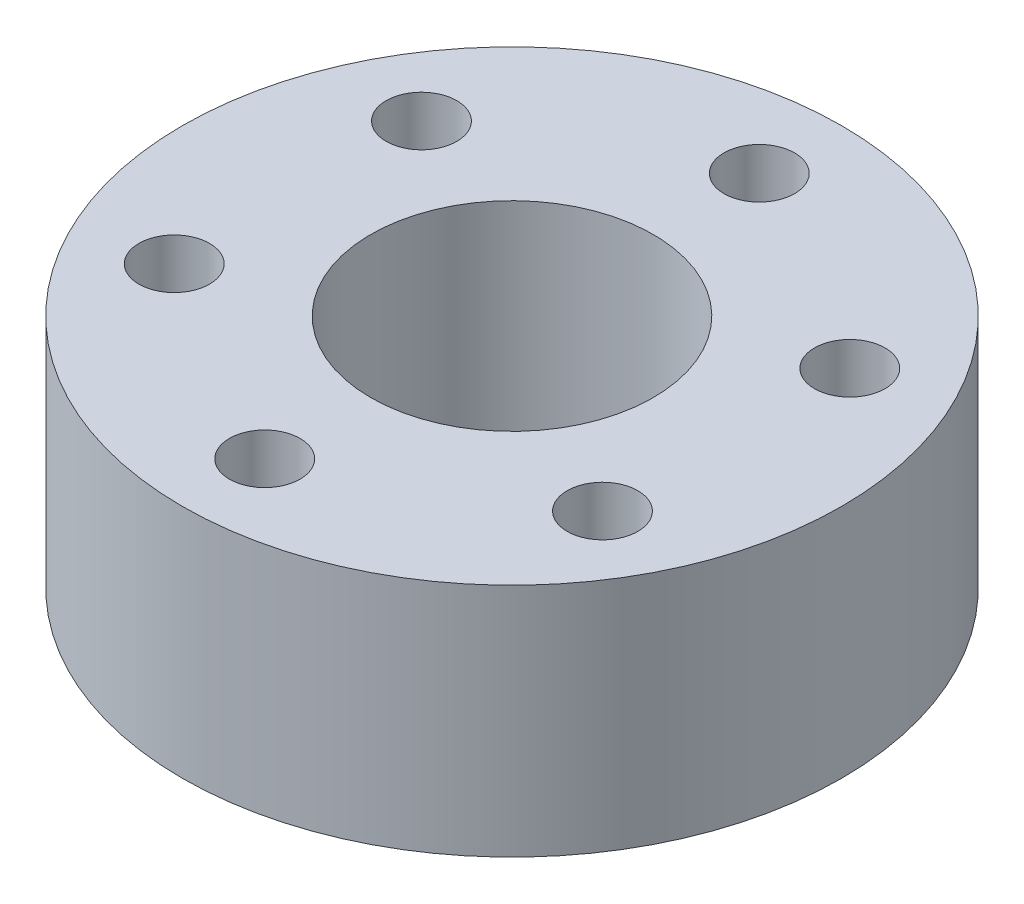
ISO-10303-21;
HEADER;
FILE_DESCRIPTION(('STEP AP214'),'2;1');
FILE_NAME('part.step','',(''),(''),'','','');
FILE_SCHEMA(('AUTOMOTIVE_DESIGN { 1 0 10303 214 1 1 1 1 }'));
ENDSEC;
DATA;
#1=APPLICATION_CONTEXT('core data for automotive mechanical design processes');
#2=APPLICATION_PROTOCOL_DEFINITION('international standard','automotive_design',2000,#1);
#3=PRODUCT_CONTEXT('',#1,'mechanical');
#4=PRODUCT('Part','Part','',(#3));
#5=PRODUCT_RELATED_PRODUCT_CATEGORY('part','',(#4));
#6=PRODUCT_DEFINITION_FORMATION('','',#4);
#7=PRODUCT_DEFINITION_CONTEXT('part definition',#1,'design');
#8=PRODUCT_DEFINITION('design','',#6,#7);
#9=PRODUCT_DEFINITION_SHAPE('','',#8);
#10=(LENGTH_UNIT() NAMED_UNIT(*) SI_UNIT(.MILLI.,.METRE.));
#11=(NAMED_UNIT(*) PLANE_ANGLE_UNIT() SI_UNIT($,.RADIAN.));
#12=(NAMED_UNIT(*) SI_UNIT($,.STERADIAN.) SOLID_ANGLE_UNIT());
#13=UNCERTAINTY_MEASURE_WITH_UNIT(LENGTH_MEASURE(1.E-05),#10,'distance_accuracy_value','');
#14=(GEOMETRIC_REPRESENTATION_CONTEXT(3) GLOBAL_UNCERTAINTY_ASSIGNED_CONTEXT((#13)) GLOBAL_UNIT_ASSIGNED_CONTEXT((#10,
#11,#12)) REPRESENTATION_CONTEXT('',''));
#15=CARTESIAN_POINT('',(0.,0.,0.));
#16=DIRECTION('',(0.,0.,1.));
#17=DIRECTION('',(1.,0.,0.));
#18=AXIS2_PLACEMENT_3D('',#15,#16,#17);
#19=CARTESIAN_POINT('',(0.,10.,0.));
#20=DIRECTION('',(0.,-1.,0.));
#21=DIRECTION('',(0.,0.,-1.));
#22=AXIS2_PLACEMENT_3D('',#19,#20,#21);
#23=CYLINDRICAL_SURFACE('',#22,14.);
#24=CARTESIAN_POINT('',(0.,10.,0.));
#25=DIRECTION('',(0.,1.,0.));
#26=DIRECTION('',(0.,0.,1.));
#27=AXIS2_PLACEMENT_3D('',#24,#25,#26);
#28=CIRCLE('',#27,14.);
#29=CARTESIAN_POINT('',(0.,10.,14.));
#30=VERTEX_POINT('',#29);
#31=EDGE_CURVE('E10',#30,#30,#28,.T.);
#32=ORIENTED_EDGE('',*,*,#31,.F.);
#33=EDGE_LOOP('',(#32));
#34=FACE_BOUND('',#33,.T.);
#35=CARTESIAN_POINT('',(0.,0.,0.));
#36=DIRECTION('',(0.,1.,0.));
#37=DIRECTION('',(0.,0.,1.));
#38=AXIS2_PLACEMENT_3D('',#35,#36,#37);
#39=CIRCLE('',#38,14.);
#40=CARTESIAN_POINT('',(0.,0.,14.));
#41=VERTEX_POINT('',#40);
#42=EDGE_CURVE('E33',#41,#41,#39,.T.);
#43=ORIENTED_EDGE('',*,*,#42,.T.);
#44=EDGE_LOOP('',(#43));
#45=FACE_BOUND('',#44,.T.);
#46=ADVANCED_FACE('F30',(#34,#45),#23,.T.);
#47=CARTESIAN_POINT('',(0.,10.,0.));
#48=DIRECTION('',(0.,1.,0.));
#49=DIRECTION('',(0.,0.,1.));
#50=AXIS2_PLACEMENT_3D('',#47,#48,#49);
#51=PLANE('',#50);
#52=CARTESIAN_POINT('',(0.,10.,-10.5));
#53=DIRECTION('',(0.,1.,0.));
#54=DIRECTION('',(0.,0.,1.));
#55=AXIS2_PLACEMENT_3D('',#52,#53,#54);
#56=CIRCLE('',#55,1.5);
#57=CARTESIAN_POINT('',(0.,10.,-9.));
#58=VERTEX_POINT('',#57);
#59=EDGE_CURVE('E67',#58,#58,#56,.T.);
#60=ORIENTED_EDGE('',*,*,#59,.F.);
#61=EDGE_LOOP('',(#60));
#62=FACE_BOUND('',#61,.T.);
#63=CARTESIAN_POINT('',(-9.09326673973645,10.,5.25000000000028));
#64=DIRECTION('',(0.,1.,0.));
#65=DIRECTION('',(0.,0.,1.));
#66=AXIS2_PLACEMENT_3D('',#63,#64,#65);
#67=CIRCLE('',#66,1.5);
#68=CARTESIAN_POINT('',(-9.09326673973645,10.,6.75000000000028));
#69=VERTEX_POINT('',#68);
#70=EDGE_CURVE('E68',#69,#69,#67,.T.);
#71=ORIENTED_EDGE('',*,*,#70,.F.);
#72=EDGE_LOOP('',(#71));
#73=FACE_BOUND('',#72,.T.);
#74=CARTESIAN_POINT('',(1.00440489259057E-12,10.,10.5));
#75=DIRECTION('',(0.,1.,0.));
#76=DIRECTION('',(0.,0.,1.));
#77=AXIS2_PLACEMENT_3D('',#74,#75,#76);
#78=CIRCLE('',#77,1.5);
#79=CARTESIAN_POINT('',(1.00440489259057E-12,10.,12.));
#80=VERTEX_POINT('',#79);
#81=EDGE_CURVE('E74',#80,#80,#78,.T.);
#82=ORIENTED_EDGE('',*,*,#81,.F.);
#83=EDGE_LOOP('',(#82));
#84=FACE_BOUND('',#83,.T.);
#85=CARTESIAN_POINT('',(9.09326673973705,10.,5.24999999999924));
#86=DIRECTION('',(0.,1.,0.));
#87=DIRECTION('',(0.,0.,1.));
#88=AXIS2_PLACEMENT_3D('',#85,#86,#87);
#89=CIRCLE('',#88,1.5);
#90=CARTESIAN_POINT('',(9.09326673973705,10.,6.74999999999924));
#91=VERTEX_POINT('',#90);
#92=EDGE_CURVE('E42',#91,#91,#89,.T.);
#93=ORIENTED_EDGE('',*,*,#92,.F.);
#94=EDGE_LOOP('',(#93));
#95=FACE_BOUND('',#94,.T.);
#96=CARTESIAN_POINT('',(9.09326673973649,10.,-5.25000000000021));
#97=DIRECTION('',(0.,1.,0.));
#98=DIRECTION('',(0.,0.,1.));
#99=AXIS2_PLACEMENT_3D('',#96,#97,#98);
#100=CIRCLE('',#99,1.5);
#101=CARTESIAN_POINT('',(9.09326673973649,10.,-3.75000000000021));
#102=VERTEX_POINT('',#101);
#103=EDGE_CURVE('E49',#102,#102,#100,.T.);
#104=ORIENTED_EDGE('',*,*,#103,.F.);
#105=EDGE_LOOP('',(#104));
#106=FACE_BOUND('',#105,.T.);
#107=CARTESIAN_POINT('',(-9.09326673973655,10.,-5.25000000000011));
#108=DIRECTION('',(0.,1.,0.));
#109=DIRECTION('',(0.,0.,1.));
#110=AXIS2_PLACEMENT_3D('',#107,#108,#109);
#111=CIRCLE('',#110,1.5);
#112=CARTESIAN_POINT('',(-9.09326673973655,10.,-3.75000000000011));
#113=VERTEX_POINT('',#112);
#114=EDGE_CURVE('E55',#113,#113,#111,.T.);
#115=ORIENTED_EDGE('',*,*,#114,.F.);
#116=EDGE_LOOP('',(#115));
#117=FACE_BOUND('',#116,.T.);
#118=CARTESIAN_POINT('',(0.,10.,0.));
#119=DIRECTION('',(0.,1.,0.));
#120=DIRECTION('',(0.,0.,1.));
#121=AXIS2_PLACEMENT_3D('',#118,#119,#120);
#122=CIRCLE('',#121,6.);
#123=CARTESIAN_POINT('',(0.,10.,6.));
#124=VERTEX_POINT('',#123);
#125=EDGE_CURVE('E61',#124,#124,#122,.T.);
#126=ORIENTED_EDGE('',*,*,#125,.F.);
#127=EDGE_LOOP('',(#126));
#128=FACE_BOUND('',#127,.T.);
#129=ORIENTED_EDGE('',*,*,#31,.T.);
#130=EDGE_LOOP('',(#129));
#131=FACE_BOUND('',#130,.T.);
#132=ADVANCED_FACE('F94',(#62,#73,#84,#95,#106,#117,#128,#131),#51,.T.);
#133=CARTESIAN_POINT('',(0.,0.,0.));
#134=DIRECTION('',(0.,1.,0.));
#135=DIRECTION('',(0.,0.,1.));
#136=AXIS2_PLACEMENT_3D('',#133,#134,#135);
#137=PLANE('',#136);
#138=CARTESIAN_POINT('',(0.,0.,-10.5));
#139=DIRECTION('',(0.,1.,0.));
#140=DIRECTION('',(0.,0.,1.));
#141=AXIS2_PLACEMENT_3D('',#138,#139,#140);
#142=CIRCLE('',#141,1.5);
#143=CARTESIAN_POINT('',(0.,0.,-9.));
#144=VERTEX_POINT('',#143);
#145=EDGE_CURVE('E40',#144,#144,#142,.T.);
#146=ORIENTED_EDGE('',*,*,#145,.T.);
#147=EDGE_LOOP('',(#146));
#148=FACE_BOUND('',#147,.T.);
#149=CARTESIAN_POINT('',(-9.09326673973645,0.,5.25000000000028));
#150=DIRECTION('',(0.,1.,0.));
#151=DIRECTION('',(0.,0.,1.));
#152=AXIS2_PLACEMENT_3D('',#149,#150,#151);
#153=CIRCLE('',#152,1.5);
#154=CARTESIAN_POINT('',(-9.09326673973645,0.,6.75000000000028));
#155=VERTEX_POINT('',#154);
#156=EDGE_CURVE('E71',#155,#155,#153,.T.);
#157=ORIENTED_EDGE('',*,*,#156,.T.);
#158=EDGE_LOOP('',(#157));
#159=FACE_BOUND('',#158,.T.);
#160=CARTESIAN_POINT('',(1.00440489259057E-12,0.,10.5));
#161=DIRECTION('',(0.,1.,0.));
#162=DIRECTION('',(0.,0.,1.));
#163=AXIS2_PLACEMENT_3D('',#160,#161,#162);
#164=CIRCLE('',#163,1.5);
#165=CARTESIAN_POINT('',(1.00440489259057E-12,0.,12.));
#166=VERTEX_POINT('',#165);
#167=EDGE_CURVE('E46',#166,#166,#164,.T.);
#168=ORIENTED_EDGE('',*,*,#167,.T.);
#169=EDGE_LOOP('',(#168));
#170=FACE_BOUND('',#169,.T.);
#171=CARTESIAN_POINT('',(9.09326673973705,0.,5.24999999999924));
#172=DIRECTION('',(0.,1.,0.));
#173=DIRECTION('',(0.,0.,1.));
#174=AXIS2_PLACEMENT_3D('',#171,#172,#173);
#175=CIRCLE('',#174,1.5);
#176=CARTESIAN_POINT('',(9.09326673973705,0.,6.74999999999924));
#177=VERTEX_POINT('',#176);
#178=EDGE_CURVE('E45',#177,#177,#175,.T.);
#179=ORIENTED_EDGE('',*,*,#178,.T.);
#180=EDGE_LOOP('',(#179));
#181=FACE_BOUND('',#180,.T.);
#182=CARTESIAN_POINT('',(9.09326673973649,0.,-5.25000000000021));
#183=DIRECTION('',(0.,1.,0.));
#184=DIRECTION('',(0.,0.,1.));
#185=AXIS2_PLACEMENT_3D('',#182,#183,#184);
#186=CIRCLE('',#185,1.5);
#187=CARTESIAN_POINT('',(9.09326673973649,0.,-3.75000000000021));
#188=VERTEX_POINT('',#187);
#189=EDGE_CURVE('E52',#188,#188,#186,.T.);
#190=ORIENTED_EDGE('',*,*,#189,.T.);
#191=EDGE_LOOP('',(#190));
#192=FACE_BOUND('',#191,.T.);
#193=CARTESIAN_POINT('',(-9.09326673973655,0.,-5.25000000000011));
#194=DIRECTION('',(0.,1.,0.));
#195=DIRECTION('',(0.,0.,1.));
#196=AXIS2_PLACEMENT_3D('',#193,#194,#195);
#197=CIRCLE('',#196,1.5);
#198=CARTESIAN_POINT('',(-9.09326673973655,0.,-3.75000000000011));
#199=VERTEX_POINT('',#198);
#200=EDGE_CURVE('E58',#199,#199,#197,.T.);
#201=ORIENTED_EDGE('',*,*,#200,.T.);
#202=EDGE_LOOP('',(#201));
#203=FACE_BOUND('',#202,.T.);
#204=CARTESIAN_POINT('',(0.,0.,0.));
#205=DIRECTION('',(0.,1.,0.));
#206=DIRECTION('',(0.,0.,1.));
#207=AXIS2_PLACEMENT_3D('',#204,#205,#206);
#208=CIRCLE('',#207,6.);
#209=CARTESIAN_POINT('',(0.,0.,6.));
#210=VERTEX_POINT('',#209);
#211=EDGE_CURVE('E64',#210,#210,#208,.T.);
#212=ORIENTED_EDGE('',*,*,#211,.T.);
#213=EDGE_LOOP('',(#212));
#214=FACE_BOUND('',#213,.T.);
#215=ORIENTED_EDGE('',*,*,#42,.F.);
#216=EDGE_LOOP('',(#215));
#217=FACE_BOUND('',#216,.T.);
#218=ADVANCED_FACE('F84',(#148,#159,#170,#181,#192,#203,#214,#217),#137,.F.);
#219=CARTESIAN_POINT('',(0.,0.,0.));
#220=DIRECTION('',(0.,1.,0.));
#221=DIRECTION('',(0.,0.,1.));
#222=AXIS2_PLACEMENT_3D('',#219,#220,#221);
#223=CYLINDRICAL_SURFACE('',#222,6.);
#224=ORIENTED_EDGE('',*,*,#211,.F.);
#225=EDGE_LOOP('',(#224));
#226=FACE_BOUND('',#225,.T.);
#227=ORIENTED_EDGE('',*,*,#125,.T.);
#228=EDGE_LOOP('',(#227));
#229=FACE_BOUND('',#228,.T.);
#230=ADVANCED_FACE('F110',(#226,#229),#223,.F.);
#231=CARTESIAN_POINT('',(-9.09326673973655,0.,-5.25000000000011));
#232=DIRECTION('',(0.,1.,0.));
#233=DIRECTION('',(0.,0.,1.));
#234=AXIS2_PLACEMENT_3D('',#231,#232,#233);
#235=CYLINDRICAL_SURFACE('',#234,1.5);
#236=ORIENTED_EDGE('',*,*,#200,.F.);
#237=EDGE_LOOP('',(#236));
#238=FACE_BOUND('',#237,.T.);
#239=ORIENTED_EDGE('',*,*,#114,.T.);
#240=EDGE_LOOP('',(#239));
#241=FACE_BOUND('',#240,.T.);
#242=ADVANCED_FACE('F112',(#238,#241),#235,.F.);
#243=CARTESIAN_POINT('',(9.09326673973649,0.,-5.25000000000021));
#244=DIRECTION('',(0.,1.,0.));
#245=DIRECTION('',(0.,0.,1.));
#246=AXIS2_PLACEMENT_3D('',#243,#244,#245);
#247=CYLINDRICAL_SURFACE('',#246,1.5);
#248=ORIENTED_EDGE('',*,*,#189,.F.);
#249=EDGE_LOOP('',(#248));
#250=FACE_BOUND('',#249,.T.);
#251=ORIENTED_EDGE('',*,*,#103,.T.);
#252=EDGE_LOOP('',(#251));
#253=FACE_BOUND('',#252,.T.);
#254=ADVANCED_FACE('F119',(#250,#253),#247,.F.);
#255=CARTESIAN_POINT('',(9.09326673973705,0.,5.24999999999924));
#256=DIRECTION('',(0.,1.,0.));
#257=DIRECTION('',(0.,0.,1.));
#258=AXIS2_PLACEMENT_3D('',#255,#256,#257);
#259=CYLINDRICAL_SURFACE('',#258,1.5);
#260=ORIENTED_EDGE('',*,*,#178,.F.);
#261=EDGE_LOOP('',(#260));
#262=FACE_BOUND('',#261,.T.);
#263=ORIENTED_EDGE('',*,*,#92,.T.);
#264=EDGE_LOOP('',(#263));
#265=FACE_BOUND('',#264,.T.);
#266=ADVANCED_FACE('F158',(#262,#265),#259,.F.);
#267=CARTESIAN_POINT('',(1.00440489259057E-12,0.,10.5));
#268=DIRECTION('',(0.,1.,0.));
#269=DIRECTION('',(0.,0.,1.));
#270=AXIS2_PLACEMENT_3D('',#267,#268,#269);
#271=CYLINDRICAL_SURFACE('',#270,1.5);
#272=ORIENTED_EDGE('',*,*,#167,.F.);
#273=EDGE_LOOP('',(#272));
#274=FACE_BOUND('',#273,.T.);
#275=ORIENTED_EDGE('',*,*,#81,.T.);
#276=EDGE_LOOP('',(#275));
#277=FACE_BOUND('',#276,.T.);
#278=ADVANCED_FACE('F168',(#274,#277),#271,.F.);
#279=CARTESIAN_POINT('',(-9.09326673973645,0.,5.25000000000028));
#280=DIRECTION('',(0.,1.,0.));
#281=DIRECTION('',(0.,0.,1.));
#282=AXIS2_PLACEMENT_3D('',#279,#280,#281);
#283=CYLINDRICAL_SURFACE('',#282,1.5);
#284=ORIENTED_EDGE('',*,*,#156,.F.);
#285=EDGE_LOOP('',(#284));
#286=FACE_BOUND('',#285,.T.);
#287=ORIENTED_EDGE('',*,*,#70,.T.);
#288=EDGE_LOOP('',(#287));
#289=FACE_BOUND('',#288,.T.);
#290=ADVANCED_FACE('F90',(#286,#289),#283,.F.);
#291=CARTESIAN_POINT('',(0.,0.,-10.5));
#292=DIRECTION('',(0.,1.,0.));
#293=DIRECTION('',(0.,0.,1.));
#294=AXIS2_PLACEMENT_3D('',#291,#292,#293);
#295=CYLINDRICAL_SURFACE('',#294,1.5);
#296=ORIENTED_EDGE('',*,*,#145,.F.);
#297=EDGE_LOOP('',(#296));
#298=FACE_BOUND('',#297,.T.);
#299=ORIENTED_EDGE('',*,*,#59,.T.);
#300=EDGE_LOOP('',(#299));
#301=FACE_BOUND('',#300,.T.);
#302=ADVANCED_FACE('F87',(#298,#301),#295,.F.);
#303=CLOSED_SHELL('',(#46,#132,#218,#230,#242,#254,#266,#278,#290,#302));
#304=MANIFOLD_SOLID_BREP('B2',#303);
#305=ADVANCED_BREP_SHAPE_REPRESENTATION('',(#18,#304),#14);
#306=SHAPE_DEFINITION_REPRESENTATION(#9,#305);
ENDSEC;
END-ISO-10303-21;
